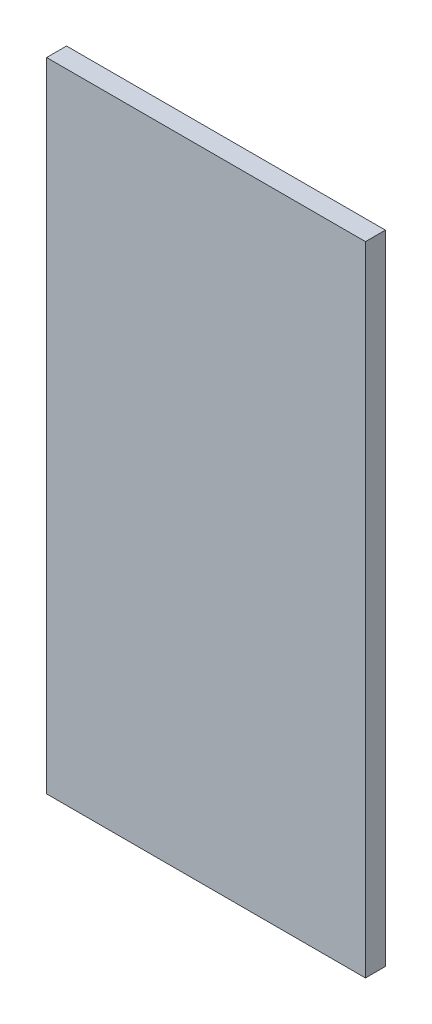
ISO-10303-21;
HEADER;
FILE_DESCRIPTION(('STEP AP214'),'2;1');
FILE_NAME('part.step','',(''),(''),'','','');
FILE_SCHEMA(('AUTOMOTIVE_DESIGN { 1 0 10303 214 1 1 1 1 }'));
ENDSEC;
DATA;
#1=APPLICATION_CONTEXT('core data for automotive mechanical design processes');
#2=APPLICATION_PROTOCOL_DEFINITION('international standard','automotive_design',2000,#1);
#3=PRODUCT_CONTEXT('',#1,'mechanical');
#4=PRODUCT('Part','Part','',(#3));
#5=PRODUCT_RELATED_PRODUCT_CATEGORY('part','',(#4));
#6=PRODUCT_DEFINITION_FORMATION('','',#4);
#7=PRODUCT_DEFINITION_CONTEXT('part definition',#1,'design');
#8=PRODUCT_DEFINITION('design','',#6,#7);
#9=PRODUCT_DEFINITION_SHAPE('','',#8);
#10=(LENGTH_UNIT() NAMED_UNIT(*) SI_UNIT(.MILLI.,.METRE.));
#11=(NAMED_UNIT(*) PLANE_ANGLE_UNIT() SI_UNIT($,.RADIAN.));
#12=(NAMED_UNIT(*) SI_UNIT($,.STERADIAN.) SOLID_ANGLE_UNIT());
#13=UNCERTAINTY_MEASURE_WITH_UNIT(LENGTH_MEASURE(1.E-05),#10,'distance_accuracy_value','');
#14=(GEOMETRIC_REPRESENTATION_CONTEXT(3) GLOBAL_UNCERTAINTY_ASSIGNED_CONTEXT((#13)) GLOBAL_UNIT_ASSIGNED_CONTEXT((#10,
#11,#12)) REPRESENTATION_CONTEXT('',''));
#15=CARTESIAN_POINT('',(0.,0.,0.));
#16=DIRECTION('',(0.,0.,1.));
#17=DIRECTION('',(1.,0.,0.));
#18=AXIS2_PLACEMENT_3D('',#15,#16,#17);
#19=CARTESIAN_POINT('',(-50.8,-101.6,6.35));
#20=DIRECTION('',(1.,0.,0.));
#21=DIRECTION('',(0.,0.,-1.));
#22=AXIS2_PLACEMENT_3D('',#19,#20,#21);
#23=PLANE('',#22);
#24=DIRECTION('',(0.,-1.,0.));
#25=VECTOR('',#24,1.);
#26=CARTESIAN_POINT('',(-50.8,-101.6,0.));
#27=LINE('',#26,#25);
#28=CARTESIAN_POINT('',(-50.8,101.6,0.));
#29=VERTEX_POINT('',#28);
#30=CARTESIAN_POINT('',(-50.8,-101.6,0.));
#31=VERTEX_POINT('',#30);
#32=EDGE_CURVE('E100',#29,#31,#27,.T.);
#33=ORIENTED_EDGE('',*,*,#32,.T.);
#34=DIRECTION('',(0.,0.,-1.));
#35=VECTOR('',#34,1.);
#36=CARTESIAN_POINT('',(-50.8,-101.6,6.35));
#37=LINE('',#36,#35);
#38=CARTESIAN_POINT('',(-50.8,-101.6,6.35));
#39=VERTEX_POINT('',#38);
#40=EDGE_CURVE('E11',#39,#31,#37,.T.);
#41=ORIENTED_EDGE('',*,*,#40,.F.);
#42=DIRECTION('',(0.,-1.,0.));
#43=VECTOR('',#42,1.);
#44=CARTESIAN_POINT('',(-50.8,-101.6,6.35));
#45=LINE('',#44,#43);
#46=CARTESIAN_POINT('',(-50.8,101.6,6.35));
#47=VERTEX_POINT('',#46);
#48=EDGE_CURVE('E88',#47,#39,#45,.T.);
#49=ORIENTED_EDGE('',*,*,#48,.F.);
#50=DIRECTION('',(0.,0.,-1.));
#51=VECTOR('',#50,1.);
#52=CARTESIAN_POINT('',(-50.8,101.6,6.35));
#53=LINE('',#52,#51);
#54=EDGE_CURVE('E96',#47,#29,#53,.T.);
#55=ORIENTED_EDGE('',*,*,#54,.T.);
#56=EDGE_LOOP('',(#33,#41,#49,#55));
#57=FACE_BOUND('',#56,.T.);
#58=ADVANCED_FACE('F37',(#57),#23,.F.);
#59=CARTESIAN_POINT('',(50.8,-101.6,6.35));
#60=DIRECTION('',(0.,1.,0.));
#61=DIRECTION('',(0.,0.,1.));
#62=AXIS2_PLACEMENT_3D('',#59,#60,#61);
#63=PLANE('',#62);
#64=DIRECTION('',(1.,0.,0.));
#65=VECTOR('',#64,1.);
#66=CARTESIAN_POINT('',(50.8,-101.6,0.));
#67=LINE('',#66,#65);
#68=CARTESIAN_POINT('',(50.8,-101.6,0.));
#69=VERTEX_POINT('',#68);
#70=EDGE_CURVE('E92',#31,#69,#67,.T.);
#71=ORIENTED_EDGE('',*,*,#70,.T.);
#72=DIRECTION('',(0.,0.,-1.));
#73=VECTOR('',#72,1.);
#74=CARTESIAN_POINT('',(50.8,-101.6,6.35));
#75=LINE('',#74,#73);
#76=CARTESIAN_POINT('',(50.8,-101.6,6.35));
#77=VERTEX_POINT('',#76);
#78=EDGE_CURVE('E45',#77,#69,#75,.T.);
#79=ORIENTED_EDGE('',*,*,#78,.F.);
#80=DIRECTION('',(1.,0.,0.));
#81=VECTOR('',#80,1.);
#82=CARTESIAN_POINT('',(50.8,-101.6,6.35));
#83=LINE('',#82,#81);
#84=EDGE_CURVE('E83',#39,#77,#83,.T.);
#85=ORIENTED_EDGE('',*,*,#84,.F.);
#86=ORIENTED_EDGE('',*,*,#40,.T.);
#87=EDGE_LOOP('',(#71,#79,#85,#86));
#88=FACE_BOUND('',#87,.T.);
#89=ADVANCED_FACE('F91',(#88),#63,.F.);
#90=CARTESIAN_POINT('',(50.8,-101.6,6.35));
#91=DIRECTION('',(-1.,0.,0.));
#92=DIRECTION('',(0.,0.,1.));
#93=AXIS2_PLACEMENT_3D('',#90,#91,#92);
#94=PLANE('',#93);
#95=DIRECTION('',(0.,1.,0.));
#96=VECTOR('',#95,1.);
#97=CARTESIAN_POINT('',(50.8,-101.6,0.));
#98=LINE('',#97,#96);
#99=CARTESIAN_POINT('',(50.8,101.6,0.));
#100=VERTEX_POINT('',#99);
#101=EDGE_CURVE('E70',#69,#100,#98,.T.);
#102=ORIENTED_EDGE('',*,*,#101,.T.);
#103=DIRECTION('',(0.,0.,-1.));
#104=VECTOR('',#103,1.);
#105=CARTESIAN_POINT('',(50.8,101.6,6.35));
#106=LINE('',#105,#104);
#107=CARTESIAN_POINT('',(50.8,101.6,6.35));
#108=VERTEX_POINT('',#107);
#109=EDGE_CURVE('E93',#108,#100,#106,.T.);
#110=ORIENTED_EDGE('',*,*,#109,.F.);
#111=DIRECTION('',(0.,1.,0.));
#112=VECTOR('',#111,1.);
#113=CARTESIAN_POINT('',(50.8,-101.6,6.35));
#114=LINE('',#113,#112);
#115=EDGE_CURVE('E86',#77,#108,#114,.T.);
#116=ORIENTED_EDGE('',*,*,#115,.F.);
#117=ORIENTED_EDGE('',*,*,#78,.T.);
#118=EDGE_LOOP('',(#102,#110,#116,#117));
#119=FACE_BOUND('',#118,.T.);
#120=ADVANCED_FACE('F94',(#119),#94,.F.);
#121=CARTESIAN_POINT('',(50.8,101.6,6.35));
#122=DIRECTION('',(0.,-1.,0.));
#123=DIRECTION('',(0.,0.,-1.));
#124=AXIS2_PLACEMENT_3D('',#121,#122,#123);
#125=PLANE('',#124);
#126=DIRECTION('',(-1.,0.,0.));
#127=VECTOR('',#126,1.);
#128=CARTESIAN_POINT('',(50.8,101.6,0.));
#129=LINE('',#128,#127);
#130=EDGE_CURVE('E76',#100,#29,#129,.T.);
#131=ORIENTED_EDGE('',*,*,#130,.T.);
#132=ORIENTED_EDGE('',*,*,#54,.F.);
#133=DIRECTION('',(-1.,0.,0.));
#134=VECTOR('',#133,1.);
#135=CARTESIAN_POINT('',(50.8,101.6,6.35));
#136=LINE('',#135,#134);
#137=EDGE_CURVE('E53',#108,#47,#136,.T.);
#138=ORIENTED_EDGE('',*,*,#137,.F.);
#139=ORIENTED_EDGE('',*,*,#109,.T.);
#140=EDGE_LOOP('',(#131,#132,#138,#139));
#141=FACE_BOUND('',#140,.T.);
#142=ADVANCED_FACE('F107',(#141),#125,.F.);
#143=CARTESIAN_POINT('',(0.,0.,6.35));
#144=DIRECTION('',(0.,0.,1.));
#145=DIRECTION('',(1.,0.,0.));
#146=AXIS2_PLACEMENT_3D('',#143,#144,#145);
#147=PLANE('',#146);
#148=ORIENTED_EDGE('',*,*,#48,.T.);
#149=ORIENTED_EDGE('',*,*,#84,.T.);
#150=ORIENTED_EDGE('',*,*,#115,.T.);
#151=ORIENTED_EDGE('',*,*,#137,.T.);
#152=EDGE_LOOP('',(#148,#149,#150,#151));
#153=FACE_BOUND('',#152,.T.);
#154=ADVANCED_FACE('F84',(#153),#147,.T.);
#155=CARTESIAN_POINT('',(0.,0.,0.));
#156=DIRECTION('',(0.,0.,1.));
#157=DIRECTION('',(1.,0.,0.));
#158=AXIS2_PLACEMENT_3D('',#155,#156,#157);
#159=PLANE('',#158);
#160=ORIENTED_EDGE('',*,*,#32,.F.);
#161=ORIENTED_EDGE('',*,*,#130,.F.);
#162=ORIENTED_EDGE('',*,*,#101,.F.);
#163=ORIENTED_EDGE('',*,*,#70,.F.);
#164=EDGE_LOOP('',(#160,#161,#162,#163));
#165=FACE_BOUND('',#164,.T.);
#166=ADVANCED_FACE('F110',(#165),#159,.F.);
#167=CLOSED_SHELL('',(#58,#89,#120,#142,#154,#166));
#168=MANIFOLD_SOLID_BREP('B2',#167);
#169=ADVANCED_BREP_SHAPE_REPRESENTATION('',(#18,#168),#14);
#170=SHAPE_DEFINITION_REPRESENTATION(#9,#169);
ENDSEC;
END-ISO-10303-21;
